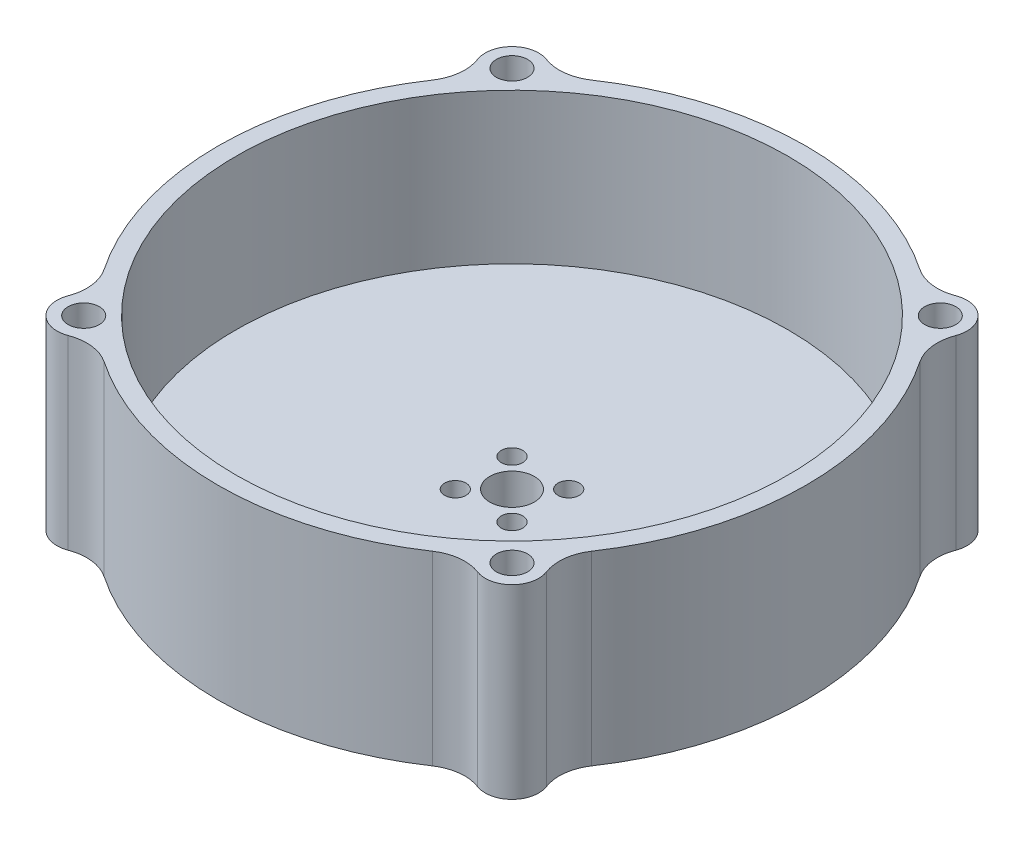
ISO-10303-21;
HEADER;
FILE_DESCRIPTION(('STEP AP214'),'2;1');
FILE_NAME('part.step','',(''),(''),'','','');
FILE_SCHEMA(('AUTOMOTIVE_DESIGN { 1 0 10303 214 1 1 1 1 }'));
ENDSEC;
DATA;
#1=APPLICATION_CONTEXT('core data for automotive mechanical design processes');
#2=APPLICATION_PROTOCOL_DEFINITION('international standard','automotive_design',2000,#1);
#3=PRODUCT_CONTEXT('',#1,'mechanical');
#4=PRODUCT('Part','Part','',(#3));
#5=PRODUCT_RELATED_PRODUCT_CATEGORY('part','',(#4));
#6=PRODUCT_DEFINITION_FORMATION('','',#4);
#7=PRODUCT_DEFINITION_CONTEXT('part definition',#1,'design');
#8=PRODUCT_DEFINITION('design','',#6,#7);
#9=PRODUCT_DEFINITION_SHAPE('','',#8);
#10=(LENGTH_UNIT() NAMED_UNIT(*) SI_UNIT(.MILLI.,.METRE.));
#11=(NAMED_UNIT(*) PLANE_ANGLE_UNIT() SI_UNIT($,.RADIAN.));
#12=(NAMED_UNIT(*) SI_UNIT($,.STERADIAN.) SOLID_ANGLE_UNIT());
#13=UNCERTAINTY_MEASURE_WITH_UNIT(LENGTH_MEASURE(1.E-05),#10,'distance_accuracy_value','');
#14=(GEOMETRIC_REPRESENTATION_CONTEXT(3) GLOBAL_UNCERTAINTY_ASSIGNED_CONTEXT((#13)) GLOBAL_UNIT_ASSIGNED_CONTEXT((#10,
#11,#12)) REPRESENTATION_CONTEXT('',''));
#15=CARTESIAN_POINT('',(0.,0.,0.));
#16=DIRECTION('',(0.,0.,1.));
#17=DIRECTION('',(1.,0.,0.));
#18=AXIS2_PLACEMENT_3D('',#15,#16,#17);
#19=CARTESIAN_POINT('',(0.,4.,0.));
#20=DIRECTION('',(0.,-1.,0.));
#21=DIRECTION('',(0.,0.,-1.));
#22=AXIS2_PLACEMENT_3D('',#19,#20,#21);
#23=CYLINDRICAL_SURFACE('',#22,33.);
#24=CARTESIAN_POINT('',(0.,0.,0.));
#25=DIRECTION('',(0.,1.,0.));
#26=DIRECTION('',(0.,0.,1.));
#27=AXIS2_PLACEMENT_3D('',#24,#25,#26);
#28=CIRCLE('',#27,33.);
#29=CARTESIAN_POINT('',(18.4243234866216,0.,-27.3778067795856));
#30=VERTEX_POINT('',#29);
#31=CARTESIAN_POINT('',(-18.4243234866216,0.,-27.3778067795856));
#32=VERTEX_POINT('',#31);
#33=EDGE_CURVE('E258',#30,#32,#28,.T.);
#34=ORIENTED_EDGE('',*,*,#33,.T.);
#35=DIRECTION('',(0.,-1.,0.));
#36=VECTOR('',#35,1.);
#37=CARTESIAN_POINT('',(-18.4243234866217,4.,-27.3778067795856));
#38=LINE('',#37,#36);
#39=CARTESIAN_POINT('',(-18.4243234866216,20.88,-27.3778067795856));
#40=VERTEX_POINT('',#39);
#41=EDGE_CURVE('E336',#32,#40,#38,.F.);
#42=ORIENTED_EDGE('',*,*,#41,.T.);
#43=CARTESIAN_POINT('',(0.,20.88,0.));
#44=DIRECTION('',(0.,1.,0.));
#45=DIRECTION('',(0.,0.,1.));
#46=AXIS2_PLACEMENT_3D('',#43,#44,#45);
#47=CIRCLE('',#46,33.);
#48=CARTESIAN_POINT('',(18.4243234866216,20.88,-27.3778067795856));
#49=VERTEX_POINT('',#48);
#50=EDGE_CURVE('E253',#49,#40,#47,.T.);
#51=ORIENTED_EDGE('',*,*,#50,.F.);
#52=DIRECTION('',(0.,-1.,0.));
#53=VECTOR('',#52,1.);
#54=CARTESIAN_POINT('',(18.4243234866216,4.,-27.3778067795856));
#55=LINE('',#54,#53);
#56=EDGE_CURVE('E275',#49,#30,#55,.T.);
#57=ORIENTED_EDGE('',*,*,#56,.T.);
#58=EDGE_LOOP('',(#34,#42,#51,#57));
#59=FACE_BOUND('',#58,.T.);
#60=ADVANCED_FACE('F43',(#59),#23,.T.);
#61=CARTESIAN_POINT('',(-27.3778067795854,20.88,-18.4243234866219));
#62=VERTEX_POINT('',#61);
#63=CARTESIAN_POINT('',(-27.3778067795854,20.88,18.4243234866219));
#64=VERTEX_POINT('',#63);
#65=EDGE_CURVE('E257',#62,#64,#47,.T.);
#66=ORIENTED_EDGE('',*,*,#65,.F.);
#67=DIRECTION('',(0.,-1.,0.));
#68=VECTOR('',#67,1.);
#69=CARTESIAN_POINT('',(-27.3778067795854,4.,-18.4243234866219));
#70=LINE('',#69,#68);
#71=CARTESIAN_POINT('',(-27.3778067795854,0.,-18.4243234866219));
#72=VERTEX_POINT('',#71);
#73=EDGE_CURVE('E329',#62,#72,#70,.T.);
#74=ORIENTED_EDGE('',*,*,#73,.T.);
#75=CARTESIAN_POINT('',(-27.3778067795854,0.,18.4243234866219));
#76=VERTEX_POINT('',#75);
#77=EDGE_CURVE('E261',#72,#76,#28,.T.);
#78=ORIENTED_EDGE('',*,*,#77,.T.);
#79=DIRECTION('',(0.,-1.,0.));
#80=VECTOR('',#79,1.);
#81=CARTESIAN_POINT('',(-27.3778067795854,4.,18.4243234866219));
#82=LINE('',#81,#80);
#83=EDGE_CURVE('E317',#76,#64,#82,.F.);
#84=ORIENTED_EDGE('',*,*,#83,.T.);
#85=EDGE_LOOP('',(#66,#74,#78,#84));
#86=FACE_BOUND('',#85,.T.);
#87=ADVANCED_FACE('F441',(#86),#23,.T.);
#88=CARTESIAN_POINT('',(-18.4243234866216,20.88,27.3778067795856));
#89=VERTEX_POINT('',#88);
#90=CARTESIAN_POINT('',(18.4243234866218,20.88,27.3778067795854));
#91=VERTEX_POINT('',#90);
#92=EDGE_CURVE('E463',#89,#91,#47,.T.);
#93=ORIENTED_EDGE('',*,*,#92,.F.);
#94=DIRECTION('',(0.,-1.,0.));
#95=VECTOR('',#94,1.);
#96=CARTESIAN_POINT('',(-18.4243234866216,4.,27.3778067795856));
#97=LINE('',#96,#95);
#98=CARTESIAN_POINT('',(-18.4243234866216,0.,27.3778067795856));
#99=VERTEX_POINT('',#98);
#100=EDGE_CURVE('E310',#89,#99,#97,.T.);
#101=ORIENTED_EDGE('',*,*,#100,.T.);
#102=CARTESIAN_POINT('',(18.4243234866218,0.,27.3778067795854));
#103=VERTEX_POINT('',#102);
#104=EDGE_CURVE('E468',#99,#103,#28,.T.);
#105=ORIENTED_EDGE('',*,*,#104,.T.);
#106=DIRECTION('',(0.,-1.,0.));
#107=VECTOR('',#106,1.);
#108=CARTESIAN_POINT('',(18.4243234866218,4.,27.3778067795854));
#109=LINE('',#108,#107);
#110=EDGE_CURVE('E298',#103,#91,#109,.F.);
#111=ORIENTED_EDGE('',*,*,#110,.T.);
#112=EDGE_LOOP('',(#93,#101,#105,#111));
#113=FACE_BOUND('',#112,.T.);
#114=ADVANCED_FACE('F447',(#113),#23,.T.);
#115=CARTESIAN_POINT('',(27.3778067795855,20.88,18.4243234866217));
#116=VERTEX_POINT('',#115);
#117=CARTESIAN_POINT('',(27.3778067795854,20.88,-18.4243234866219));
#118=VERTEX_POINT('',#117);
#119=EDGE_CURVE('E252',#116,#118,#47,.T.);
#120=ORIENTED_EDGE('',*,*,#119,.F.);
#121=DIRECTION('',(0.,-1.,0.));
#122=VECTOR('',#121,1.);
#123=CARTESIAN_POINT('',(27.3778067795855,4.,18.4243234866217));
#124=LINE('',#123,#122);
#125=CARTESIAN_POINT('',(27.3778067795855,0.,18.4243234866217));
#126=VERTEX_POINT('',#125);
#127=EDGE_CURVE('E291',#116,#126,#124,.T.);
#128=ORIENTED_EDGE('',*,*,#127,.T.);
#129=CARTESIAN_POINT('',(27.3778067795854,0.,-18.4243234866219));
#130=VERTEX_POINT('',#129);
#131=EDGE_CURVE('E256',#126,#130,#28,.T.);
#132=ORIENTED_EDGE('',*,*,#131,.T.);
#133=DIRECTION('',(0.,-1.,0.));
#134=VECTOR('',#133,1.);
#135=CARTESIAN_POINT('',(27.3778067795854,4.,-18.4243234866219));
#136=LINE('',#135,#134);
#137=EDGE_CURVE('E264',#130,#118,#136,.F.);
#138=ORIENTED_EDGE('',*,*,#137,.T.);
#139=EDGE_LOOP('',(#120,#128,#132,#138));
#140=FACE_BOUND('',#139,.T.);
#141=ADVANCED_FACE('F443',(#140),#23,.T.);
#142=CARTESIAN_POINT('',(0.,0.,0.));
#143=DIRECTION('',(0.,1.,0.));
#144=DIRECTION('',(0.,0.,1.));
#145=AXIS2_PLACEMENT_3D('',#142,#143,#144);
#146=PLANE('',#145);
#147=CARTESIAN_POINT('',(24.0416305603427,0.,24.0416305603426));
#148=DIRECTION('',(0.,1.,0.));
#149=DIRECTION('',(0.,0.,1.));
#150=AXIS2_PLACEMENT_3D('',#147,#148,#149);
#151=CIRCLE('',#150,1.74999999999999);
#152=CARTESIAN_POINT('',(24.0416305603427,0.,25.7916305603426));
#153=VERTEX_POINT('',#152);
#154=EDGE_CURVE('E406',#153,#153,#151,.T.);
#155=ORIENTED_EDGE('',*,*,#154,.T.);
#156=EDGE_LOOP('',(#155));
#157=FACE_BOUND('',#156,.T.);
#158=CARTESIAN_POINT('',(-24.0416305603425,0.,24.0416305603427));
#159=DIRECTION('',(0.,1.,0.));
#160=DIRECTION('',(0.,0.,1.));
#161=AXIS2_PLACEMENT_3D('',#158,#159,#160);
#162=CIRCLE('',#161,1.74999999999999);
#163=CARTESIAN_POINT('',(-24.0416305603425,0.,25.7916305603427));
#164=VERTEX_POINT('',#163);
#165=EDGE_CURVE('E400',#164,#164,#162,.T.);
#166=ORIENTED_EDGE('',*,*,#165,.T.);
#167=EDGE_LOOP('',(#166));
#168=FACE_BOUND('',#167,.T.);
#169=CARTESIAN_POINT('',(-24.0416305603425,0.,-24.0416305603427));
#170=DIRECTION('',(0.,1.,0.));
#171=DIRECTION('',(0.,0.,1.));
#172=AXIS2_PLACEMENT_3D('',#169,#170,#171);
#173=CIRCLE('',#172,1.74999999999999);
#174=CARTESIAN_POINT('',(-24.0416305603425,0.,-22.2916305603427));
#175=VERTEX_POINT('',#174);
#176=EDGE_CURVE('E394',#175,#175,#173,.T.);
#177=ORIENTED_EDGE('',*,*,#176,.T.);
#178=EDGE_LOOP('',(#177));
#179=FACE_BOUND('',#178,.T.);
#180=CARTESIAN_POINT('',(24.0416305603425,0.,-24.0416305603427));
#181=DIRECTION('',(0.,1.,0.));
#182=DIRECTION('',(0.,0.,1.));
#183=AXIS2_PLACEMENT_3D('',#180,#181,#182);
#184=CIRCLE('',#183,1.74999999999999);
#185=CARTESIAN_POINT('',(24.0416305603425,0.,-22.2916305603428));
#186=VERTEX_POINT('',#185);
#187=EDGE_CURVE('E354',#186,#186,#184,.T.);
#188=ORIENTED_EDGE('',*,*,#187,.T.);
#189=EDGE_LOOP('',(#188));
#190=FACE_BOUND('',#189,.T.);
#191=DIRECTION('',(0.,0.,1.));
#192=VECTOR('',#191,1.);
#193=CARTESIAN_POINT('',(13.5,0.,4.));
#194=LINE('',#193,#192);
#195=CARTESIAN_POINT('',(13.5,0.,-4.));
#196=VERTEX_POINT('',#195);
#197=CARTESIAN_POINT('',(13.5,0.,4.));
#198=VERTEX_POINT('',#197);
#199=EDGE_CURVE('E192',#196,#198,#194,.T.);
#200=ORIENTED_EDGE('',*,*,#199,.T.);
#201=CARTESIAN_POINT('',(15.,0.,4.));
#202=DIRECTION('',(0.,1.,0.));
#203=DIRECTION('',(0.,0.,1.));
#204=AXIS2_PLACEMENT_3D('',#201,#202,#203);
#205=CIRCLE('',#204,1.5);
#206=CARTESIAN_POINT('',(16.5,0.,4.));
#207=VERTEX_POINT('',#206);
#208=EDGE_CURVE('E184',#198,#207,#205,.T.);
#209=ORIENTED_EDGE('',*,*,#208,.T.);
#210=DIRECTION('',(0.,0.,-1.));
#211=VECTOR('',#210,1.);
#212=CARTESIAN_POINT('',(16.5,0.,4.));
#213=LINE('',#212,#211);
#214=CARTESIAN_POINT('',(16.5,0.,-4.));
#215=VERTEX_POINT('',#214);
#216=EDGE_CURVE('E196',#207,#215,#213,.T.);
#217=ORIENTED_EDGE('',*,*,#216,.T.);
#218=CARTESIAN_POINT('',(15.,0.,-4.));
#219=DIRECTION('',(0.,1.,0.));
#220=DIRECTION('',(0.,0.,1.));
#221=AXIS2_PLACEMENT_3D('',#218,#219,#220);
#222=CIRCLE('',#221,1.5);
#223=EDGE_CURVE('E200',#215,#196,#222,.T.);
#224=ORIENTED_EDGE('',*,*,#223,.T.);
#225=EDGE_LOOP('',(#200,#209,#217,#224));
#226=FACE_BOUND('',#225,.T.);
#227=CARTESIAN_POINT('',(0.,0.,0.));
#228=DIRECTION('',(0.,1.,0.));
#229=DIRECTION('',(0.,0.,1.));
#230=AXIS2_PLACEMENT_3D('',#227,#228,#229);
#231=CIRCLE('',#230,2.5);
#232=CARTESIAN_POINT('',(0.,0.,2.5));
#233=VERTEX_POINT('',#232);
#234=EDGE_CURVE('E228',#233,#233,#231,.T.);
#235=ORIENTED_EDGE('',*,*,#234,.T.);
#236=EDGE_LOOP('',(#235));
#237=FACE_BOUND('',#236,.T.);
#238=CARTESIAN_POINT('',(-3.18198051533946,0.,-3.18198051533946));
#239=DIRECTION('',(0.,-1.,0.));
#240=DIRECTION('',(0.,0.,-1.));
#241=AXIS2_PLACEMENT_3D('',#238,#239,#240);
#242=CIRCLE('',#241,1.2);
#243=CARTESIAN_POINT('',(-3.18198051533946,0.,-4.38198051533946));
#244=VERTEX_POINT('',#243);
#245=EDGE_CURVE('E231',#244,#244,#242,.T.);
#246=ORIENTED_EDGE('',*,*,#245,.F.);
#247=EDGE_LOOP('',(#246));
#248=FACE_BOUND('',#247,.T.);
#249=CARTESIAN_POINT('',(-3.18198051533946,0.,3.18198051533946));
#250=DIRECTION('',(0.,-1.,0.));
#251=DIRECTION('',(0.,0.,-1.));
#252=AXIS2_PLACEMENT_3D('',#249,#250,#251);
#253=CIRCLE('',#252,1.2);
#254=CARTESIAN_POINT('',(-3.18198051533946,0.,1.98198051533947));
#255=VERTEX_POINT('',#254);
#256=EDGE_CURVE('E237',#255,#255,#253,.T.);
#257=ORIENTED_EDGE('',*,*,#256,.F.);
#258=EDGE_LOOP('',(#257));
#259=FACE_BOUND('',#258,.T.);
#260=CARTESIAN_POINT('',(3.18198051533946,0.,3.18198051533946));
#261=DIRECTION('',(0.,-1.,0.));
#262=DIRECTION('',(0.,0.,-1.));
#263=AXIS2_PLACEMENT_3D('',#260,#261,#262);
#264=CIRCLE('',#263,1.2);
#265=CARTESIAN_POINT('',(3.18198051533946,0.,1.98198051533947));
#266=VERTEX_POINT('',#265);
#267=EDGE_CURVE('E241',#266,#266,#264,.T.);
#268=ORIENTED_EDGE('',*,*,#267,.F.);
#269=EDGE_LOOP('',(#268));
#270=FACE_BOUND('',#269,.T.);
#271=CARTESIAN_POINT('',(3.18198051533946,0.,-3.18198051533946));
#272=DIRECTION('',(0.,-1.,0.));
#273=DIRECTION('',(0.,0.,-1.));
#274=AXIS2_PLACEMENT_3D('',#271,#272,#273);
#275=CIRCLE('',#274,1.2);
#276=CARTESIAN_POINT('',(3.18198051533946,0.,-4.38198051533946));
#277=VERTEX_POINT('',#276);
#278=EDGE_CURVE('E245',#277,#277,#275,.T.);
#279=ORIENTED_EDGE('',*,*,#278,.F.);
#280=EDGE_LOOP('',(#279));
#281=FACE_BOUND('',#280,.T.);
#282=ORIENTED_EDGE('',*,*,#77,.F.);
#283=CARTESIAN_POINT('',(-31.5259593219468,0.,-21.2158876512616));
#284=DIRECTION('',(0.,1.,0.));
#285=DIRECTION('',(0.,0.,1.));
#286=AXIS2_PLACEMENT_3D('',#283,#284,#285);
#287=CIRCLE('',#286,5.);
#288=CARTESIAN_POINT('',(-26.8482538459441,0.,-22.9819769694373));
#289=VERTEX_POINT('',#288);
#290=EDGE_CURVE('E338',#72,#289,#287,.T.);
#291=ORIENTED_EDGE('',*,*,#290,.T.);
#292=CARTESIAN_POINT('',(-24.0416305603425,0.,-24.0416305603427));
#293=DIRECTION('',(0.,1.,0.));
#294=DIRECTION('',(1.,0.,0.));
#295=AXIS2_PLACEMENT_3D('',#292,#293,#294);
#296=CIRCLE('',#295,3.);
#297=CARTESIAN_POINT('',(-22.981976969437,0.,-26.8482538459443));
#298=VERTEX_POINT('',#297);
#299=EDGE_CURVE('E353',#298,#289,#296,.T.);
#300=ORIENTED_EDGE('',*,*,#299,.F.);
#301=CARTESIAN_POINT('',(-21.2158876512613,0.,-31.525959321947));
#302=DIRECTION('',(0.,1.,0.));
#303=DIRECTION('',(0.,0.,1.));
#304=AXIS2_PLACEMENT_3D('',#301,#302,#303);
#305=CIRCLE('',#304,5.);
#306=EDGE_CURVE('E11',#298,#32,#305,.T.);
#307=ORIENTED_EDGE('',*,*,#306,.T.);
#308=ORIENTED_EDGE('',*,*,#33,.F.);
#309=CARTESIAN_POINT('',(21.2158876512613,0.,-31.525959321947));
#310=DIRECTION('',(0.,1.,0.));
#311=DIRECTION('',(0.,0.,1.));
#312=AXIS2_PLACEMENT_3D('',#309,#310,#311);
#313=CIRCLE('',#312,5.);
#314=CARTESIAN_POINT('',(22.981976969437,0.,-26.8482538459444));
#315=VERTEX_POINT('',#314);
#316=EDGE_CURVE('E282',#30,#315,#313,.T.);
#317=ORIENTED_EDGE('',*,*,#316,.T.);
#318=CARTESIAN_POINT('',(24.0416305603425,0.,-24.0416305603427));
#319=DIRECTION('',(0.,1.,0.));
#320=DIRECTION('',(0.,0.,1.));
#321=AXIS2_PLACEMENT_3D('',#318,#319,#320);
#322=CIRCLE('',#321,3.);
#323=CARTESIAN_POINT('',(26.8482538459441,0.,-22.9819769694373));
#324=VERTEX_POINT('',#323);
#325=EDGE_CURVE('E218',#324,#315,#322,.T.);
#326=ORIENTED_EDGE('',*,*,#325,.F.);
#327=CARTESIAN_POINT('',(31.5259593219468,0.,-21.2158876512616));
#328=DIRECTION('',(0.,1.,0.));
#329=DIRECTION('',(0.,0.,1.));
#330=AXIS2_PLACEMENT_3D('',#327,#328,#329);
#331=CIRCLE('',#330,5.);
#332=EDGE_CURVE('E288',#324,#130,#331,.T.);
#333=ORIENTED_EDGE('',*,*,#332,.T.);
#334=ORIENTED_EDGE('',*,*,#131,.F.);
#335=CARTESIAN_POINT('',(31.525959321947,0.,21.2158876512614));
#336=DIRECTION('',(0.,1.,0.));
#337=DIRECTION('',(0.,0.,1.));
#338=AXIS2_PLACEMENT_3D('',#335,#336,#337);
#339=CIRCLE('',#338,5.);
#340=CARTESIAN_POINT('',(26.8482538459443,0.,22.9819769694371));
#341=VERTEX_POINT('',#340);
#342=EDGE_CURVE('E301',#126,#341,#339,.T.);
#343=ORIENTED_EDGE('',*,*,#342,.T.);
#344=CARTESIAN_POINT('',(24.0416305603427,0.,24.0416305603426));
#345=DIRECTION('',(0.,1.,0.));
#346=DIRECTION('',(-1.,0.,0.));
#347=AXIS2_PLACEMENT_3D('',#344,#345,#346);
#348=CIRCLE('',#347,3.);
#349=CARTESIAN_POINT('',(22.9819769694372,0.,26.8482538459442));
#350=VERTEX_POINT('',#349);
#351=EDGE_CURVE('E372',#350,#341,#348,.T.);
#352=ORIENTED_EDGE('',*,*,#351,.F.);
#353=CARTESIAN_POINT('',(21.2158876512615,0.,31.5259593219469));
#354=DIRECTION('',(0.,1.,0.));
#355=DIRECTION('',(0.,0.,1.));
#356=AXIS2_PLACEMENT_3D('',#353,#354,#355);
#357=CIRCLE('',#356,5.);
#358=EDGE_CURVE('E307',#350,#103,#357,.T.);
#359=ORIENTED_EDGE('',*,*,#358,.T.);
#360=ORIENTED_EDGE('',*,*,#104,.F.);
#361=CARTESIAN_POINT('',(-21.2158876512613,0.,31.525959321947));
#362=DIRECTION('',(0.,1.,0.));
#363=DIRECTION('',(0.,0.,1.));
#364=AXIS2_PLACEMENT_3D('',#361,#362,#363);
#365=CIRCLE('',#364,5.);
#366=CARTESIAN_POINT('',(-22.981976969437,0.,26.8482538459444));
#367=VERTEX_POINT('',#366);
#368=EDGE_CURVE('E320',#99,#367,#365,.T.);
#369=ORIENTED_EDGE('',*,*,#368,.T.);
#370=CARTESIAN_POINT('',(-24.0416305603425,0.,24.0416305603427));
#371=DIRECTION('',(0.,1.,0.));
#372=DIRECTION('',(0.,0.,-1.));
#373=AXIS2_PLACEMENT_3D('',#370,#371,#372);
#374=CIRCLE('',#373,3.);
#375=CARTESIAN_POINT('',(-26.8482538459441,0.,22.9819769694373));
#376=VERTEX_POINT('',#375);
#377=EDGE_CURVE('E380',#376,#367,#374,.T.);
#378=ORIENTED_EDGE('',*,*,#377,.F.);
#379=CARTESIAN_POINT('',(-31.5259593219468,0.,21.2158876512616));
#380=DIRECTION('',(0.,1.,0.));
#381=DIRECTION('',(0.,0.,1.));
#382=AXIS2_PLACEMENT_3D('',#379,#380,#381);
#383=CIRCLE('',#382,5.);
#384=EDGE_CURVE('E326',#376,#76,#383,.T.);
#385=ORIENTED_EDGE('',*,*,#384,.T.);
#386=EDGE_LOOP('',(#282,#291,#300,#307,#308,#317,#326,#333,#334,#343,#352,#359,#360,#369,#378,#385));
#387=FACE_BOUND('',#386,.T.);
#388=ADVANCED_FACE('F202',(#157,#168,#179,#190,#226,#237,#248,#259,#270,#281,#387),#146,.F.);
#389=CARTESIAN_POINT('',(0.,20.88,0.));
#390=DIRECTION('',(0.,1.,0.));
#391=DIRECTION('',(0.,0.,1.));
#392=AXIS2_PLACEMENT_3D('',#389,#390,#391);
#393=PLANE('',#392);
#394=CARTESIAN_POINT('',(24.0416305603427,20.88,24.0416305603426));
#395=DIRECTION('',(0.,1.,0.));
#396=DIRECTION('',(0.,0.,1.));
#397=AXIS2_PLACEMENT_3D('',#394,#395,#396);
#398=CIRCLE('',#397,1.75);
#399=CARTESIAN_POINT('',(24.0416305603427,20.88,25.7916305603426));
#400=VERTEX_POINT('',#399);
#401=EDGE_CURVE('E409',#400,#400,#398,.T.);
#402=ORIENTED_EDGE('',*,*,#401,.F.);
#403=EDGE_LOOP('',(#402));
#404=FACE_BOUND('',#403,.T.);
#405=CARTESIAN_POINT('',(-24.0416305603425,20.88,24.0416305603427));
#406=DIRECTION('',(0.,1.,0.));
#407=DIRECTION('',(0.,0.,1.));
#408=AXIS2_PLACEMENT_3D('',#405,#406,#407);
#409=CIRCLE('',#408,1.75);
#410=CARTESIAN_POINT('',(-24.0416305603425,20.88,25.7916305603427));
#411=VERTEX_POINT('',#410);
#412=EDGE_CURVE('E403',#411,#411,#409,.T.);
#413=ORIENTED_EDGE('',*,*,#412,.F.);
#414=EDGE_LOOP('',(#413));
#415=FACE_BOUND('',#414,.T.);
#416=CARTESIAN_POINT('',(-24.0416305603425,20.88,-24.0416305603427));
#417=DIRECTION('',(0.,1.,0.));
#418=DIRECTION('',(0.,0.,1.));
#419=AXIS2_PLACEMENT_3D('',#416,#417,#418);
#420=CIRCLE('',#419,1.75);
#421=CARTESIAN_POINT('',(-24.0416305603425,20.88,-22.2916305603427));
#422=VERTEX_POINT('',#421);
#423=EDGE_CURVE('E397',#422,#422,#420,.T.);
#424=ORIENTED_EDGE('',*,*,#423,.F.);
#425=EDGE_LOOP('',(#424));
#426=FACE_BOUND('',#425,.T.);
#427=CARTESIAN_POINT('',(24.0416305603425,20.88,-24.0416305603427));
#428=DIRECTION('',(0.,1.,0.));
#429=DIRECTION('',(0.,0.,1.));
#430=AXIS2_PLACEMENT_3D('',#427,#428,#429);
#431=CIRCLE('',#430,1.75);
#432=CARTESIAN_POINT('',(24.0416305603425,20.88,-22.2916305603427));
#433=VERTEX_POINT('',#432);
#434=EDGE_CURVE('E391',#433,#433,#431,.T.);
#435=ORIENTED_EDGE('',*,*,#434,.F.);
#436=EDGE_LOOP('',(#435));
#437=FACE_BOUND('',#436,.T.);
#438=ORIENTED_EDGE('',*,*,#50,.T.);
#439=CARTESIAN_POINT('',(-21.2158876512613,20.88,-31.525959321947));
#440=DIRECTION('',(0.,1.,0.));
#441=DIRECTION('',(0.,0.,1.));
#442=AXIS2_PLACEMENT_3D('',#439,#440,#441);
#443=CIRCLE('',#442,5.);
#444=CARTESIAN_POINT('',(-22.981976969437,20.88,-26.8482538459443));
#445=VERTEX_POINT('',#444);
#446=EDGE_CURVE('E51',#40,#445,#443,.F.);
#447=ORIENTED_EDGE('',*,*,#446,.T.);
#448=CARTESIAN_POINT('',(-24.0416305603425,20.88,-24.0416305603427));
#449=DIRECTION('',(0.,1.,0.));
#450=DIRECTION('',(1.,0.,0.));
#451=AXIS2_PLACEMENT_3D('',#448,#449,#450);
#452=CIRCLE('',#451,3.);
#453=CARTESIAN_POINT('',(-26.8482538459441,20.88,-22.9819769694373));
#454=VERTEX_POINT('',#453);
#455=EDGE_CURVE('E346',#445,#454,#452,.T.);
#456=ORIENTED_EDGE('',*,*,#455,.T.);
#457=CARTESIAN_POINT('',(-31.5259593219468,20.88,-21.2158876512616));
#458=DIRECTION('',(0.,1.,0.));
#459=DIRECTION('',(0.,0.,1.));
#460=AXIS2_PLACEMENT_3D('',#457,#458,#459);
#461=CIRCLE('',#460,5.);
#462=EDGE_CURVE('E340',#454,#62,#461,.F.);
#463=ORIENTED_EDGE('',*,*,#462,.T.);
#464=ORIENTED_EDGE('',*,*,#65,.T.);
#465=CARTESIAN_POINT('',(-31.5259593219468,20.88,21.2158876512616));
#466=DIRECTION('',(0.,1.,0.));
#467=DIRECTION('',(0.,0.,1.));
#468=AXIS2_PLACEMENT_3D('',#465,#466,#467);
#469=CIRCLE('',#468,5.);
#470=CARTESIAN_POINT('',(-26.8482538459441,20.88,22.9819769694373));
#471=VERTEX_POINT('',#470);
#472=EDGE_CURVE('E324',#64,#471,#469,.F.);
#473=ORIENTED_EDGE('',*,*,#472,.T.);
#474=CARTESIAN_POINT('',(-24.0416305603425,20.88,24.0416305603427));
#475=DIRECTION('',(0.,1.,0.));
#476=DIRECTION('',(0.,0.,-1.));
#477=AXIS2_PLACEMENT_3D('',#474,#475,#476);
#478=CIRCLE('',#477,3.);
#479=CARTESIAN_POINT('',(-22.981976969437,20.88,26.8482538459444));
#480=VERTEX_POINT('',#479);
#481=EDGE_CURVE('E383',#471,#480,#478,.T.);
#482=ORIENTED_EDGE('',*,*,#481,.T.);
#483=CARTESIAN_POINT('',(-21.2158876512613,20.88,31.525959321947));
#484=DIRECTION('',(0.,1.,0.));
#485=DIRECTION('',(0.,0.,1.));
#486=AXIS2_PLACEMENT_3D('',#483,#484,#485);
#487=CIRCLE('',#486,5.);
#488=EDGE_CURVE('E322',#480,#89,#487,.F.);
#489=ORIENTED_EDGE('',*,*,#488,.T.);
#490=ORIENTED_EDGE('',*,*,#92,.T.);
#491=CARTESIAN_POINT('',(21.2158876512615,20.88,31.5259593219469));
#492=DIRECTION('',(0.,1.,0.));
#493=DIRECTION('',(0.,0.,1.));
#494=AXIS2_PLACEMENT_3D('',#491,#492,#493);
#495=CIRCLE('',#494,5.);
#496=CARTESIAN_POINT('',(22.9819769694372,20.88,26.8482538459442));
#497=VERTEX_POINT('',#496);
#498=EDGE_CURVE('E305',#91,#497,#495,.F.);
#499=ORIENTED_EDGE('',*,*,#498,.T.);
#500=CARTESIAN_POINT('',(24.0416305603427,20.88,24.0416305603426));
#501=DIRECTION('',(0.,1.,0.));
#502=DIRECTION('',(-1.,0.,0.));
#503=AXIS2_PLACEMENT_3D('',#500,#501,#502);
#504=CIRCLE('',#503,3.);
#505=CARTESIAN_POINT('',(26.8482538459443,20.88,22.9819769694371));
#506=VERTEX_POINT('',#505);
#507=EDGE_CURVE('E374',#497,#506,#504,.T.);
#508=ORIENTED_EDGE('',*,*,#507,.T.);
#509=CARTESIAN_POINT('',(31.525959321947,20.88,21.2158876512614));
#510=DIRECTION('',(0.,1.,0.));
#511=DIRECTION('',(0.,0.,1.));
#512=AXIS2_PLACEMENT_3D('',#509,#510,#511);
#513=CIRCLE('',#512,5.);
#514=EDGE_CURVE('E303',#506,#116,#513,.F.);
#515=ORIENTED_EDGE('',*,*,#514,.T.);
#516=ORIENTED_EDGE('',*,*,#119,.T.);
#517=CARTESIAN_POINT('',(31.5259593219468,20.88,-21.2158876512616));
#518=DIRECTION('',(0.,1.,0.));
#519=DIRECTION('',(0.,0.,1.));
#520=AXIS2_PLACEMENT_3D('',#517,#518,#519);
#521=CIRCLE('',#520,5.);
#522=CARTESIAN_POINT('',(26.8482538459441,20.88,-22.9819769694373));
#523=VERTEX_POINT('',#522);
#524=EDGE_CURVE('E286',#118,#523,#521,.F.);
#525=ORIENTED_EDGE('',*,*,#524,.T.);
#526=CARTESIAN_POINT('',(24.0416305603425,20.88,-24.0416305603427));
#527=DIRECTION('',(0.,1.,0.));
#528=DIRECTION('',(0.,0.,1.));
#529=AXIS2_PLACEMENT_3D('',#526,#527,#528);
#530=CIRCLE('',#529,3.);
#531=CARTESIAN_POINT('',(22.981976969437,20.88,-26.8482538459444));
#532=VERTEX_POINT('',#531);
#533=EDGE_CURVE('E211',#523,#532,#530,.T.);
#534=ORIENTED_EDGE('',*,*,#533,.T.);
#535=CARTESIAN_POINT('',(21.2158876512613,20.88,-31.525959321947));
#536=DIRECTION('',(0.,1.,0.));
#537=DIRECTION('',(0.,0.,1.));
#538=AXIS2_PLACEMENT_3D('',#535,#536,#537);
#539=CIRCLE('',#538,5.);
#540=EDGE_CURVE('E284',#532,#49,#539,.F.);
#541=ORIENTED_EDGE('',*,*,#540,.T.);
#542=EDGE_LOOP('',(#438,#447,#456,#463,#464,#473,#482,#489,#490,#499,#508,#515,#516,#525,#534,#541));
#543=FACE_BOUND('',#542,.T.);
#544=CARTESIAN_POINT('',(0.,20.88,0.));
#545=DIRECTION('',(0.,1.,0.));
#546=DIRECTION('',(0.,0.,1.));
#547=AXIS2_PLACEMENT_3D('',#544,#545,#546);
#548=CIRCLE('',#547,31.);
#549=CARTESIAN_POINT('',(0.,20.88,31.));
#550=VERTEX_POINT('',#549);
#551=EDGE_CURVE('E249',#550,#550,#548,.T.);
#552=ORIENTED_EDGE('',*,*,#551,.F.);
#553=EDGE_LOOP('',(#552));
#554=FACE_BOUND('',#553,.T.);
#555=ADVANCED_FACE('F344',(#404,#415,#426,#437,#543,#554),#393,.T.);
#556=CARTESIAN_POINT('',(0.,20.88,0.));
#557=DIRECTION('',(0.,-1.,0.));
#558=DIRECTION('',(0.,0.,-1.));
#559=AXIS2_PLACEMENT_3D('',#556,#557,#558);
#560=CYLINDRICAL_SURFACE('',#559,31.);
#561=ORIENTED_EDGE('',*,*,#551,.T.);
#562=EDGE_LOOP('',(#561));
#563=FACE_BOUND('',#562,.T.);
#564=CARTESIAN_POINT('',(0.,4.,0.));
#565=DIRECTION('',(0.,1.,0.));
#566=DIRECTION('',(0.,0.,1.));
#567=AXIS2_PLACEMENT_3D('',#564,#565,#566);
#568=CIRCLE('',#567,31.);
#569=CARTESIAN_POINT('',(0.,4.,31.));
#570=VERTEX_POINT('',#569);
#571=EDGE_CURVE('E260',#570,#570,#568,.F.);
#572=ORIENTED_EDGE('',*,*,#571,.T.);
#573=EDGE_LOOP('',(#572));
#574=FACE_BOUND('',#573,.T.);
#575=ADVANCED_FACE('F417',(#563,#574),#560,.F.);
#576=CARTESIAN_POINT('',(0.,4.,0.));
#577=DIRECTION('',(0.,1.,0.));
#578=DIRECTION('',(0.,0.,1.));
#579=AXIS2_PLACEMENT_3D('',#576,#577,#578);
#580=PLANE('',#579);
#581=CARTESIAN_POINT('',(15.,4.,4.));
#582=DIRECTION('',(0.,1.,0.));
#583=DIRECTION('',(0.,0.,1.));
#584=AXIS2_PLACEMENT_3D('',#581,#582,#583);
#585=CIRCLE('',#584,1.5);
#586=CARTESIAN_POINT('',(13.5,4.,4.));
#587=VERTEX_POINT('',#586);
#588=CARTESIAN_POINT('',(16.5,4.,4.));
#589=VERTEX_POINT('',#588);
#590=EDGE_CURVE('E187',#587,#589,#585,.T.);
#591=ORIENTED_EDGE('',*,*,#590,.F.);
#592=DIRECTION('',(0.,0.,1.));
#593=VECTOR('',#592,1.);
#594=CARTESIAN_POINT('',(13.5,4.,4.));
#595=LINE('',#594,#593);
#596=CARTESIAN_POINT('',(13.5,4.,-4.));
#597=VERTEX_POINT('',#596);
#598=EDGE_CURVE('E205',#597,#587,#595,.T.);
#599=ORIENTED_EDGE('',*,*,#598,.F.);
#600=CARTESIAN_POINT('',(15.,4.,-4.));
#601=DIRECTION('',(0.,1.,0.));
#602=DIRECTION('',(0.,0.,1.));
#603=AXIS2_PLACEMENT_3D('',#600,#601,#602);
#604=CIRCLE('',#603,1.5);
#605=CARTESIAN_POINT('',(16.5,4.,-4.));
#606=VERTEX_POINT('',#605);
#607=EDGE_CURVE('E208',#606,#597,#604,.T.);
#608=ORIENTED_EDGE('',*,*,#607,.F.);
#609=DIRECTION('',(0.,0.,-1.));
#610=VECTOR('',#609,1.);
#611=CARTESIAN_POINT('',(16.5,4.,4.));
#612=LINE('',#611,#610);
#613=EDGE_CURVE('E217',#589,#606,#612,.T.);
#614=ORIENTED_EDGE('',*,*,#613,.F.);
#615=EDGE_LOOP('',(#591,#599,#608,#614));
#616=FACE_BOUND('',#615,.T.);
#617=CARTESIAN_POINT('',(0.,4.,0.));
#618=DIRECTION('',(0.,1.,0.));
#619=DIRECTION('',(0.,0.,1.));
#620=AXIS2_PLACEMENT_3D('',#617,#618,#619);
#621=CIRCLE('',#620,2.5);
#622=CARTESIAN_POINT('',(0.,4.,2.5));
#623=VERTEX_POINT('',#622);
#624=EDGE_CURVE('E224',#623,#623,#621,.T.);
#625=ORIENTED_EDGE('',*,*,#624,.F.);
#626=EDGE_LOOP('',(#625));
#627=FACE_BOUND('',#626,.T.);
#628=CARTESIAN_POINT('',(-3.18198051533946,4.,-3.18198051533946));
#629=DIRECTION('',(0.,1.,0.));
#630=DIRECTION('',(0.,0.,1.));
#631=AXIS2_PLACEMENT_3D('',#628,#629,#630);
#632=CIRCLE('',#631,1.2);
#633=CARTESIAN_POINT('',(-3.18198051533946,4.,-1.98198051533947));
#634=VERTEX_POINT('',#633);
#635=EDGE_CURVE('E236',#634,#634,#632,.T.);
#636=ORIENTED_EDGE('',*,*,#635,.F.);
#637=EDGE_LOOP('',(#636));
#638=FACE_BOUND('',#637,.T.);
#639=CARTESIAN_POINT('',(-3.18198051533946,4.,3.18198051533946));
#640=DIRECTION('',(0.,1.,0.));
#641=DIRECTION('',(0.,0.,1.));
#642=AXIS2_PLACEMENT_3D('',#639,#640,#641);
#643=CIRCLE('',#642,1.2);
#644=CARTESIAN_POINT('',(-3.18198051533946,4.,4.38198051533946));
#645=VERTEX_POINT('',#644);
#646=EDGE_CURVE('E240',#645,#645,#643,.T.);
#647=ORIENTED_EDGE('',*,*,#646,.F.);
#648=EDGE_LOOP('',(#647));
#649=FACE_BOUND('',#648,.T.);
#650=CARTESIAN_POINT('',(3.18198051533946,4.,3.18198051533946));
#651=DIRECTION('',(0.,1.,0.));
#652=DIRECTION('',(0.,0.,1.));
#653=AXIS2_PLACEMENT_3D('',#650,#651,#652);
#654=CIRCLE('',#653,1.2);
#655=CARTESIAN_POINT('',(3.18198051533946,4.,4.38198051533946));
#656=VERTEX_POINT('',#655);
#657=EDGE_CURVE('E244',#656,#656,#654,.T.);
#658=ORIENTED_EDGE('',*,*,#657,.F.);
#659=EDGE_LOOP('',(#658));
#660=FACE_BOUND('',#659,.T.);
#661=CARTESIAN_POINT('',(3.18198051533946,4.,-3.18198051533946));
#662=DIRECTION('',(0.,1.,0.));
#663=DIRECTION('',(0.,0.,1.));
#664=AXIS2_PLACEMENT_3D('',#661,#662,#663);
#665=CIRCLE('',#664,1.2);
#666=CARTESIAN_POINT('',(3.18198051533946,4.,-1.98198051533947));
#667=VERTEX_POINT('',#666);
#668=EDGE_CURVE('E248',#667,#667,#665,.T.);
#669=ORIENTED_EDGE('',*,*,#668,.F.);
#670=EDGE_LOOP('',(#669));
#671=FACE_BOUND('',#670,.T.);
#672=ORIENTED_EDGE('',*,*,#571,.F.);
#673=EDGE_LOOP('',(#672));
#674=FACE_BOUND('',#673,.T.);
#675=ADVANCED_FACE('F539',(#616,#627,#638,#649,#660,#671,#674),#580,.T.);
#676=CARTESIAN_POINT('',(3.18198051533946,0.,-3.18198051533946));
#677=DIRECTION('',(0.,-1.,0.));
#678=DIRECTION('',(0.,0.,-1.));
#679=AXIS2_PLACEMENT_3D('',#676,#677,#678);
#680=CYLINDRICAL_SURFACE('',#679,1.2);
#681=ORIENTED_EDGE('',*,*,#668,.T.);
#682=EDGE_LOOP('',(#681));
#683=FACE_BOUND('',#682,.T.);
#684=ORIENTED_EDGE('',*,*,#278,.T.);
#685=EDGE_LOOP('',(#684));
#686=FACE_BOUND('',#685,.T.);
#687=ADVANCED_FACE('F535',(#683,#686),#680,.F.);
#688=CARTESIAN_POINT('',(3.18198051533946,0.,3.18198051533946));
#689=DIRECTION('',(0.,-1.,0.));
#690=DIRECTION('',(0.,0.,-1.));
#691=AXIS2_PLACEMENT_3D('',#688,#689,#690);
#692=CYLINDRICAL_SURFACE('',#691,1.2);
#693=ORIENTED_EDGE('',*,*,#657,.T.);
#694=EDGE_LOOP('',(#693));
#695=FACE_BOUND('',#694,.T.);
#696=ORIENTED_EDGE('',*,*,#267,.T.);
#697=EDGE_LOOP('',(#696));
#698=FACE_BOUND('',#697,.T.);
#699=ADVANCED_FACE('F531',(#695,#698),#692,.F.);
#700=CARTESIAN_POINT('',(-3.18198051533946,0.,3.18198051533946));
#701=DIRECTION('',(0.,-1.,0.));
#702=DIRECTION('',(0.,0.,-1.));
#703=AXIS2_PLACEMENT_3D('',#700,#701,#702);
#704=CYLINDRICAL_SURFACE('',#703,1.2);
#705=ORIENTED_EDGE('',*,*,#646,.T.);
#706=EDGE_LOOP('',(#705));
#707=FACE_BOUND('',#706,.T.);
#708=ORIENTED_EDGE('',*,*,#256,.T.);
#709=EDGE_LOOP('',(#708));
#710=FACE_BOUND('',#709,.T.);
#711=ADVANCED_FACE('F527',(#707,#710),#704,.F.);
#712=CARTESIAN_POINT('',(-3.18198051533946,0.,-3.18198051533946));
#713=DIRECTION('',(0.,-1.,0.));
#714=DIRECTION('',(0.,0.,-1.));
#715=AXIS2_PLACEMENT_3D('',#712,#713,#714);
#716=CYLINDRICAL_SURFACE('',#715,1.2);
#717=ORIENTED_EDGE('',*,*,#635,.T.);
#718=EDGE_LOOP('',(#717));
#719=FACE_BOUND('',#718,.T.);
#720=ORIENTED_EDGE('',*,*,#245,.T.);
#721=EDGE_LOOP('',(#720));
#722=FACE_BOUND('',#721,.T.);
#723=ADVANCED_FACE('F523',(#719,#722),#716,.F.);
#724=CARTESIAN_POINT('',(0.,0.,0.));
#725=DIRECTION('',(0.,1.,0.));
#726=DIRECTION('',(0.,0.,1.));
#727=AXIS2_PLACEMENT_3D('',#724,#725,#726);
#728=CYLINDRICAL_SURFACE('',#727,2.5);
#729=ORIENTED_EDGE('',*,*,#234,.F.);
#730=EDGE_LOOP('',(#729));
#731=FACE_BOUND('',#730,.T.);
#732=ORIENTED_EDGE('',*,*,#624,.T.);
#733=EDGE_LOOP('',(#732));
#734=FACE_BOUND('',#733,.T.);
#735=ADVANCED_FACE('F520',(#731,#734),#728,.F.);
#736=CARTESIAN_POINT('',(15.,0.,4.));
#737=DIRECTION('',(0.,1.,0.));
#738=DIRECTION('',(0.,0.,1.));
#739=AXIS2_PLACEMENT_3D('',#736,#737,#738);
#740=CYLINDRICAL_SURFACE('',#739,1.5);
#741=ORIENTED_EDGE('',*,*,#590,.T.);
#742=DIRECTION('',(0.,1.,0.));
#743=VECTOR('',#742,1.);
#744=CARTESIAN_POINT('',(16.5,0.,4.));
#745=LINE('',#744,#743);
#746=EDGE_CURVE('E180',#207,#589,#745,.T.);
#747=ORIENTED_EDGE('',*,*,#746,.F.);
#748=ORIENTED_EDGE('',*,*,#208,.F.);
#749=DIRECTION('',(0.,1.,0.));
#750=VECTOR('',#749,1.);
#751=CARTESIAN_POINT('',(13.5,0.,4.));
#752=LINE('',#751,#750);
#753=EDGE_CURVE('E222',#198,#587,#752,.T.);
#754=ORIENTED_EDGE('',*,*,#753,.T.);
#755=EDGE_LOOP('',(#741,#747,#748,#754));
#756=FACE_BOUND('',#755,.T.);
#757=ADVANCED_FACE('F182',(#756),#740,.F.);
#758=CARTESIAN_POINT('',(13.5,0.,4.));
#759=DIRECTION('',(-1.,0.,0.));
#760=DIRECTION('',(0.,0.,1.));
#761=AXIS2_PLACEMENT_3D('',#758,#759,#760);
#762=PLANE('',#761);
#763=ORIENTED_EDGE('',*,*,#598,.T.);
#764=ORIENTED_EDGE('',*,*,#753,.F.);
#765=ORIENTED_EDGE('',*,*,#199,.F.);
#766=DIRECTION('',(0.,1.,0.));
#767=VECTOR('',#766,1.);
#768=CARTESIAN_POINT('',(13.5,0.,-4.));
#769=LINE('',#768,#767);
#770=EDGE_CURVE('E225',#196,#597,#769,.T.);
#771=ORIENTED_EDGE('',*,*,#770,.T.);
#772=EDGE_LOOP('',(#763,#764,#765,#771));
#773=FACE_BOUND('',#772,.T.);
#774=ADVANCED_FACE('F508',(#773),#762,.F.);
#775=CARTESIAN_POINT('',(15.,0.,-4.));
#776=DIRECTION('',(0.,1.,0.));
#777=DIRECTION('',(0.,0.,1.));
#778=AXIS2_PLACEMENT_3D('',#775,#776,#777);
#779=CYLINDRICAL_SURFACE('',#778,1.5);
#780=ORIENTED_EDGE('',*,*,#607,.T.);
#781=ORIENTED_EDGE('',*,*,#770,.F.);
#782=ORIENTED_EDGE('',*,*,#223,.F.);
#783=DIRECTION('',(0.,1.,0.));
#784=VECTOR('',#783,1.);
#785=CARTESIAN_POINT('',(16.5,0.,-4.));
#786=LINE('',#785,#784);
#787=EDGE_CURVE('E191',#215,#606,#786,.T.);
#788=ORIENTED_EDGE('',*,*,#787,.T.);
#789=EDGE_LOOP('',(#780,#781,#782,#788));
#790=FACE_BOUND('',#789,.T.);
#791=ADVANCED_FACE('F511',(#790),#779,.F.);
#792=CARTESIAN_POINT('',(16.5,0.,4.));
#793=DIRECTION('',(1.,0.,0.));
#794=DIRECTION('',(0.,0.,-1.));
#795=AXIS2_PLACEMENT_3D('',#792,#793,#794);
#796=PLANE('',#795);
#797=ORIENTED_EDGE('',*,*,#613,.T.);
#798=ORIENTED_EDGE('',*,*,#787,.F.);
#799=ORIENTED_EDGE('',*,*,#216,.F.);
#800=ORIENTED_EDGE('',*,*,#746,.T.);
#801=EDGE_LOOP('',(#797,#798,#799,#800));
#802=FACE_BOUND('',#801,.T.);
#803=ADVANCED_FACE('F197',(#802),#796,.F.);
#804=CARTESIAN_POINT('',(24.0416305603425,0.,-24.0416305603427));
#805=DIRECTION('',(0.,1.,0.));
#806=DIRECTION('',(0.,0.,1.));
#807=AXIS2_PLACEMENT_3D('',#804,#805,#806);
#808=CYLINDRICAL_SURFACE('',#807,3.);
#809=ORIENTED_EDGE('',*,*,#325,.T.);
#810=DIRECTION('',(0.,1.,0.));
#811=VECTOR('',#810,1.);
#812=CARTESIAN_POINT('',(22.981976969437,0.,-26.8482538459444));
#813=LINE('',#812,#811);
#814=EDGE_CURVE('E280',#315,#532,#813,.T.);
#815=ORIENTED_EDGE('',*,*,#814,.T.);
#816=ORIENTED_EDGE('',*,*,#533,.F.);
#817=DIRECTION('',(0.,1.,0.));
#818=VECTOR('',#817,1.);
#819=CARTESIAN_POINT('',(26.8482538459441,0.,-22.9819769694373));
#820=LINE('',#819,#818);
#821=EDGE_CURVE('E278',#523,#324,#820,.F.);
#822=ORIENTED_EDGE('',*,*,#821,.T.);
#823=EDGE_LOOP('',(#809,#815,#816,#822));
#824=FACE_BOUND('',#823,.T.);
#825=ADVANCED_FACE('F365',(#824),#808,.T.);
#826=CARTESIAN_POINT('',(21.2158876512613,0.,-31.525959321947));
#827=DIRECTION('',(0.,1.,0.));
#828=DIRECTION('',(0.,0.,1.));
#829=AXIS2_PLACEMENT_3D('',#826,#827,#828);
#830=CYLINDRICAL_SURFACE('',#829,5.);
#831=ORIENTED_EDGE('',*,*,#540,.F.);
#832=ORIENTED_EDGE('',*,*,#814,.F.);
#833=ORIENTED_EDGE('',*,*,#316,.F.);
#834=ORIENTED_EDGE('',*,*,#56,.F.);
#835=EDGE_LOOP('',(#831,#832,#833,#834));
#836=FACE_BOUND('',#835,.T.);
#837=ADVANCED_FACE('F370',(#836),#830,.F.);
#838=CARTESIAN_POINT('',(31.5259593219468,0.,-21.2158876512616));
#839=DIRECTION('',(0.,-1.,0.));
#840=DIRECTION('',(0.,0.,-1.));
#841=AXIS2_PLACEMENT_3D('',#838,#839,#840);
#842=CYLINDRICAL_SURFACE('',#841,5.);
#843=ORIENTED_EDGE('',*,*,#332,.F.);
#844=ORIENTED_EDGE('',*,*,#821,.F.);
#845=ORIENTED_EDGE('',*,*,#524,.F.);
#846=ORIENTED_EDGE('',*,*,#137,.F.);
#847=EDGE_LOOP('',(#843,#844,#845,#846));
#848=FACE_BOUND('',#847,.T.);
#849=ADVANCED_FACE('F496',(#848),#842,.F.);
#850=CARTESIAN_POINT('',(24.0416305603427,0.,24.0416305603426));
#851=DIRECTION('',(0.,1.,0.));
#852=DIRECTION('',(0.,0.,1.));
#853=AXIS2_PLACEMENT_3D('',#850,#851,#852);
#854=CYLINDRICAL_SURFACE('',#853,3.);
#855=ORIENTED_EDGE('',*,*,#351,.T.);
#856=DIRECTION('',(0.,1.,0.));
#857=VECTOR('',#856,1.);
#858=CARTESIAN_POINT('',(26.8482538459443,0.,22.9819769694371));
#859=LINE('',#858,#857);
#860=EDGE_CURVE('E296',#341,#506,#859,.T.);
#861=ORIENTED_EDGE('',*,*,#860,.T.);
#862=ORIENTED_EDGE('',*,*,#507,.F.);
#863=DIRECTION('',(0.,1.,0.));
#864=VECTOR('',#863,1.);
#865=CARTESIAN_POINT('',(22.9819769694372,0.,26.8482538459442));
#866=LINE('',#865,#864);
#867=EDGE_CURVE('E294',#497,#350,#866,.F.);
#868=ORIENTED_EDGE('',*,*,#867,.T.);
#869=EDGE_LOOP('',(#855,#861,#862,#868));
#870=FACE_BOUND('',#869,.T.);
#871=ADVANCED_FACE('F494',(#870),#854,.T.);
#872=CARTESIAN_POINT('',(-24.0416305603425,0.,24.0416305603427));
#873=DIRECTION('',(0.,1.,0.));
#874=DIRECTION('',(0.,0.,1.));
#875=AXIS2_PLACEMENT_3D('',#872,#873,#874);
#876=CYLINDRICAL_SURFACE('',#875,3.);
#877=ORIENTED_EDGE('',*,*,#377,.T.);
#878=DIRECTION('',(0.,1.,0.));
#879=VECTOR('',#878,1.);
#880=CARTESIAN_POINT('',(-22.981976969437,0.,26.8482538459444));
#881=LINE('',#880,#879);
#882=EDGE_CURVE('E315',#367,#480,#881,.T.);
#883=ORIENTED_EDGE('',*,*,#882,.T.);
#884=ORIENTED_EDGE('',*,*,#481,.F.);
#885=DIRECTION('',(0.,1.,0.));
#886=VECTOR('',#885,1.);
#887=CARTESIAN_POINT('',(-26.8482538459441,0.,22.9819769694373));
#888=LINE('',#887,#886);
#889=EDGE_CURVE('E313',#471,#376,#888,.F.);
#890=ORIENTED_EDGE('',*,*,#889,.T.);
#891=EDGE_LOOP('',(#877,#883,#884,#890));
#892=FACE_BOUND('',#891,.T.);
#893=ADVANCED_FACE('F482',(#892),#876,.T.);
#894=CARTESIAN_POINT('',(-24.0416305603425,0.,-24.0416305603427));
#895=DIRECTION('',(0.,1.,0.));
#896=DIRECTION('',(0.,0.,1.));
#897=AXIS2_PLACEMENT_3D('',#894,#895,#896);
#898=CYLINDRICAL_SURFACE('',#897,3.);
#899=ORIENTED_EDGE('',*,*,#299,.T.);
#900=DIRECTION('',(0.,1.,0.));
#901=VECTOR('',#900,1.);
#902=CARTESIAN_POINT('',(-26.8482538459441,0.,-22.9819769694373));
#903=LINE('',#902,#901);
#904=EDGE_CURVE('E334',#289,#454,#903,.T.);
#905=ORIENTED_EDGE('',*,*,#904,.T.);
#906=ORIENTED_EDGE('',*,*,#455,.F.);
#907=DIRECTION('',(0.,1.,0.));
#908=VECTOR('',#907,1.);
#909=CARTESIAN_POINT('',(-22.981976969437,0.,-26.8482538459443));
#910=LINE('',#909,#908);
#911=EDGE_CURVE('E332',#445,#298,#910,.F.);
#912=ORIENTED_EDGE('',*,*,#911,.T.);
#913=EDGE_LOOP('',(#899,#905,#906,#912));
#914=FACE_BOUND('',#913,.T.);
#915=ADVANCED_FACE('F351',(#914),#898,.T.);
#916=CARTESIAN_POINT('',(31.525959321947,0.,21.2158876512614));
#917=DIRECTION('',(0.,1.,0.));
#918=DIRECTION('',(0.,0.,1.));
#919=AXIS2_PLACEMENT_3D('',#916,#917,#918);
#920=CYLINDRICAL_SURFACE('',#919,5.);
#921=ORIENTED_EDGE('',*,*,#514,.F.);
#922=ORIENTED_EDGE('',*,*,#860,.F.);
#923=ORIENTED_EDGE('',*,*,#342,.F.);
#924=ORIENTED_EDGE('',*,*,#127,.F.);
#925=EDGE_LOOP('',(#921,#922,#923,#924));
#926=FACE_BOUND('',#925,.T.);
#927=ADVANCED_FACE('F466',(#926),#920,.F.);
#928=CARTESIAN_POINT('',(21.2158876512615,0.,31.5259593219469));
#929=DIRECTION('',(0.,-1.,0.));
#930=DIRECTION('',(0.,0.,-1.));
#931=AXIS2_PLACEMENT_3D('',#928,#929,#930);
#932=CYLINDRICAL_SURFACE('',#931,5.);
#933=ORIENTED_EDGE('',*,*,#358,.F.);
#934=ORIENTED_EDGE('',*,*,#867,.F.);
#935=ORIENTED_EDGE('',*,*,#498,.F.);
#936=ORIENTED_EDGE('',*,*,#110,.F.);
#937=EDGE_LOOP('',(#933,#934,#935,#936));
#938=FACE_BOUND('',#937,.T.);
#939=ADVANCED_FACE('F491',(#938),#932,.F.);
#940=CARTESIAN_POINT('',(-21.2158876512613,0.,31.525959321947));
#941=DIRECTION('',(0.,1.,0.));
#942=DIRECTION('',(0.,0.,1.));
#943=AXIS2_PLACEMENT_3D('',#940,#941,#942);
#944=CYLINDRICAL_SURFACE('',#943,5.);
#945=ORIENTED_EDGE('',*,*,#488,.F.);
#946=ORIENTED_EDGE('',*,*,#882,.F.);
#947=ORIENTED_EDGE('',*,*,#368,.F.);
#948=ORIENTED_EDGE('',*,*,#100,.F.);
#949=EDGE_LOOP('',(#945,#946,#947,#948));
#950=FACE_BOUND('',#949,.T.);
#951=ADVANCED_FACE('F485',(#950),#944,.F.);
#952=CARTESIAN_POINT('',(-31.5259593219468,0.,21.2158876512616));
#953=DIRECTION('',(0.,-1.,0.));
#954=DIRECTION('',(0.,0.,-1.));
#955=AXIS2_PLACEMENT_3D('',#952,#953,#954);
#956=CYLINDRICAL_SURFACE('',#955,5.);
#957=ORIENTED_EDGE('',*,*,#384,.F.);
#958=ORIENTED_EDGE('',*,*,#889,.F.);
#959=ORIENTED_EDGE('',*,*,#472,.F.);
#960=ORIENTED_EDGE('',*,*,#83,.F.);
#961=EDGE_LOOP('',(#957,#958,#959,#960));
#962=FACE_BOUND('',#961,.T.);
#963=ADVANCED_FACE('F478',(#962),#956,.F.);
#964=CARTESIAN_POINT('',(-31.5259593219468,0.,-21.2158876512616));
#965=DIRECTION('',(0.,1.,0.));
#966=DIRECTION('',(0.,0.,1.));
#967=AXIS2_PLACEMENT_3D('',#964,#965,#966);
#968=CYLINDRICAL_SURFACE('',#967,5.);
#969=ORIENTED_EDGE('',*,*,#462,.F.);
#970=ORIENTED_EDGE('',*,*,#904,.F.);
#971=ORIENTED_EDGE('',*,*,#290,.F.);
#972=ORIENTED_EDGE('',*,*,#73,.F.);
#973=EDGE_LOOP('',(#969,#970,#971,#972));
#974=FACE_BOUND('',#973,.T.);
#975=ADVANCED_FACE('F437',(#974),#968,.F.);
#976=CARTESIAN_POINT('',(-21.2158876512613,0.,-31.525959321947));
#977=DIRECTION('',(0.,-1.,0.));
#978=DIRECTION('',(0.,0.,-1.));
#979=AXIS2_PLACEMENT_3D('',#976,#977,#978);
#980=CYLINDRICAL_SURFACE('',#979,5.);
#981=ORIENTED_EDGE('',*,*,#306,.F.);
#982=ORIENTED_EDGE('',*,*,#911,.F.);
#983=ORIENTED_EDGE('',*,*,#446,.F.);
#984=ORIENTED_EDGE('',*,*,#41,.F.);
#985=EDGE_LOOP('',(#981,#982,#983,#984));
#986=FACE_BOUND('',#985,.T.);
#987=ADVANCED_FACE('F45',(#986),#980,.F.);
#988=CARTESIAN_POINT('',(24.0416305603425,20.88,-24.0416305603427));
#989=DIRECTION('',(0.,1.,0.));
#990=DIRECTION('',(0.,0.,1.));
#991=AXIS2_PLACEMENT_3D('',#988,#989,#990);
#992=CYLINDRICAL_SURFACE('',#991,1.75);
#993=ORIENTED_EDGE('',*,*,#187,.F.);
#994=EDGE_LOOP('',(#993));
#995=FACE_BOUND('',#994,.T.);
#996=ORIENTED_EDGE('',*,*,#434,.T.);
#997=EDGE_LOOP('',(#996));
#998=FACE_BOUND('',#997,.T.);
#999=ADVANCED_FACE('F425',(#995,#998),#992,.F.);
#1000=CARTESIAN_POINT('',(-24.0416305603425,20.88,-24.0416305603427));
#1001=DIRECTION('',(0.,1.,0.));
#1002=DIRECTION('',(0.,0.,1.));
#1003=AXIS2_PLACEMENT_3D('',#1000,#1001,#1002);
#1004=CYLINDRICAL_SURFACE('',#1003,1.75);
#1005=ORIENTED_EDGE('',*,*,#176,.F.);
#1006=EDGE_LOOP('',(#1005));
#1007=FACE_BOUND('',#1006,.T.);
#1008=ORIENTED_EDGE('',*,*,#423,.T.);
#1009=EDGE_LOOP('',(#1008));
#1010=FACE_BOUND('',#1009,.T.);
#1011=ADVANCED_FACE('F427',(#1007,#1010),#1004,.F.);
#1012=CARTESIAN_POINT('',(-24.0416305603425,20.88,24.0416305603427));
#1013=DIRECTION('',(0.,1.,0.));
#1014=DIRECTION('',(0.,0.,1.));
#1015=AXIS2_PLACEMENT_3D('',#1012,#1013,#1014);
#1016=CYLINDRICAL_SURFACE('',#1015,1.75);
#1017=ORIENTED_EDGE('',*,*,#165,.F.);
#1018=EDGE_LOOP('',(#1017));
#1019=FACE_BOUND('',#1018,.T.);
#1020=ORIENTED_EDGE('',*,*,#412,.T.);
#1021=EDGE_LOOP('',(#1020));
#1022=FACE_BOUND('',#1021,.T.);
#1023=ADVANCED_FACE('F434',(#1019,#1022),#1016,.F.);
#1024=CARTESIAN_POINT('',(24.0416305603427,20.88,24.0416305603426));
#1025=DIRECTION('',(0.,1.,0.));
#1026=DIRECTION('',(0.,0.,1.));
#1027=AXIS2_PLACEMENT_3D('',#1024,#1025,#1026);
#1028=CYLINDRICAL_SURFACE('',#1027,1.75);
#1029=ORIENTED_EDGE('',*,*,#154,.F.);
#1030=EDGE_LOOP('',(#1029));
#1031=FACE_BOUND('',#1030,.T.);
#1032=ORIENTED_EDGE('',*,*,#401,.T.);
#1033=EDGE_LOOP('',(#1032));
#1034=FACE_BOUND('',#1033,.T.);
#1035=ADVANCED_FACE('F413',(#1031,#1034),#1028,.F.);
#1036=CLOSED_SHELL('',(#60,#87,#114,#141,#388,#555,#575,#675,#687,#699,#711,#723,#735,#757,#774,
#791,#803,#825,#837,#849,#871,#893,#915,#927,#939,#951,#963,#975,#987,#999,#1011,#1023,#1035));
#1037=MANIFOLD_SOLID_BREP('B2',#1036);
#1038=ADVANCED_BREP_SHAPE_REPRESENTATION('',(#18,#1037),#14);
#1039=SHAPE_DEFINITION_REPRESENTATION(#9,#1038);
ENDSEC;
END-ISO-10303-21;
